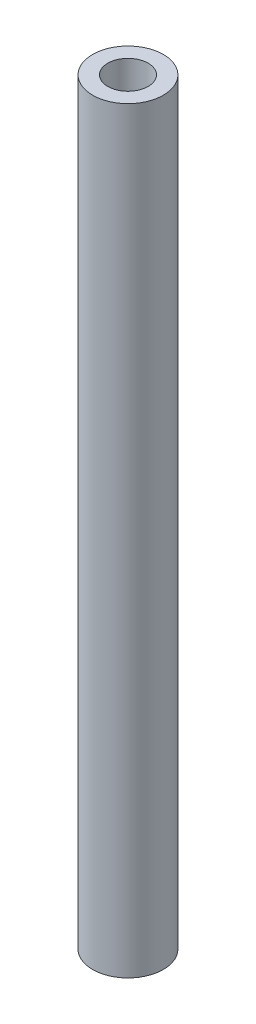
ISO-10303-21;
HEADER;
FILE_DESCRIPTION(('STEP AP214'),'2;1');
FILE_NAME('part.step','',(''),(''),'','','');
FILE_SCHEMA(('AUTOMOTIVE_DESIGN { 1 0 10303 214 1 1 1 1 }'));
ENDSEC;
DATA;
#1=APPLICATION_CONTEXT('core data for automotive mechanical design processes');
#2=APPLICATION_PROTOCOL_DEFINITION('international standard','automotive_design',2000,#1);
#3=PRODUCT_CONTEXT('',#1,'mechanical');
#4=PRODUCT('Part','Part','',(#3));
#5=PRODUCT_RELATED_PRODUCT_CATEGORY('part','',(#4));
#6=PRODUCT_DEFINITION_FORMATION('','',#4);
#7=PRODUCT_DEFINITION_CONTEXT('part definition',#1,'design');
#8=PRODUCT_DEFINITION('design','',#6,#7);
#9=PRODUCT_DEFINITION_SHAPE('','',#8);
#10=(LENGTH_UNIT() NAMED_UNIT(*) SI_UNIT(.MILLI.,.METRE.));
#11=(NAMED_UNIT(*) PLANE_ANGLE_UNIT() SI_UNIT($,.RADIAN.));
#12=(NAMED_UNIT(*) SI_UNIT($,.STERADIAN.) SOLID_ANGLE_UNIT());
#13=UNCERTAINTY_MEASURE_WITH_UNIT(LENGTH_MEASURE(1.E-05),#10,'distance_accuracy_value','');
#14=(GEOMETRIC_REPRESENTATION_CONTEXT(3) GLOBAL_UNCERTAINTY_ASSIGNED_CONTEXT((#13)) GLOBAL_UNIT_ASSIGNED_CONTEXT((#10,
#11,#12)) REPRESENTATION_CONTEXT('',''));
#15=CARTESIAN_POINT('',(0.,0.,0.));
#16=DIRECTION('',(0.,0.,1.));
#17=DIRECTION('',(1.,0.,0.));
#18=AXIS2_PLACEMENT_3D('',#15,#16,#17);
#19=CARTESIAN_POINT('',(-56.7146055400372,-75.,0.));
#20=DIRECTION('',(0.,1.,0.));
#21=DIRECTION('',(-1.,0.,0.));
#22=AXIS2_PLACEMENT_3D('',#19,#20,#21);
#23=CYLINDRICAL_SURFACE('',#22,3.50000000000001);
#24=CARTESIAN_POINT('',(-56.7146055400372,-75.,0.));
#25=DIRECTION('',(0.,1.,0.));
#26=DIRECTION('',(-1.,0.,0.));
#27=AXIS2_PLACEMENT_3D('',#24,#25,#26);
#28=CIRCLE('',#27,3.50000000000001);
#29=CARTESIAN_POINT('',(-60.2146055400372,-75.,0.));
#30=VERTEX_POINT('',#29);
#31=EDGE_CURVE('E10',#30,#30,#28,.T.);
#32=ORIENTED_EDGE('',*,*,#31,.T.);
#33=EDGE_LOOP('',(#32));
#34=FACE_BOUND('',#33,.T.);
#35=CARTESIAN_POINT('',(-56.7146055400372,0.,0.));
#36=DIRECTION('',(0.,1.,0.));
#37=DIRECTION('',(-1.,0.,0.));
#38=AXIS2_PLACEMENT_3D('',#35,#36,#37);
#39=CIRCLE('',#38,3.5);
#40=CARTESIAN_POINT('',(-60.2146055400372,0.,0.));
#41=VERTEX_POINT('',#40);
#42=EDGE_CURVE('E44',#41,#41,#39,.T.);
#43=ORIENTED_EDGE('',*,*,#42,.F.);
#44=EDGE_LOOP('',(#43));
#45=FACE_BOUND('',#44,.T.);
#46=ADVANCED_FACE('F30',(#34,#45),#23,.T.);
#47=CARTESIAN_POINT('',(-53.2146055400372,-75.,0.));
#48=DIRECTION('',(0.,-1.,0.));
#49=DIRECTION('',(1.,0.,0.));
#50=AXIS2_PLACEMENT_3D('',#47,#48,#49);
#51=PLANE('',#50);
#52=CARTESIAN_POINT('',(-56.7146055400372,-75.,0.));
#53=DIRECTION('',(0.,1.,0.));
#54=DIRECTION('',(-1.,0.,0.));
#55=AXIS2_PLACEMENT_3D('',#52,#53,#54);
#56=CIRCLE('',#55,2.);
#57=CARTESIAN_POINT('',(-58.7146055400372,-75.,0.));
#58=VERTEX_POINT('',#57);
#59=EDGE_CURVE('E36',#58,#58,#56,.T.);
#60=ORIENTED_EDGE('',*,*,#59,.T.);
#61=EDGE_LOOP('',(#60));
#62=FACE_BOUND('',#61,.T.);
#63=ORIENTED_EDGE('',*,*,#31,.F.);
#64=EDGE_LOOP('',(#63));
#65=FACE_BOUND('',#64,.T.);
#66=ADVANCED_FACE('F54',(#62,#65),#51,.T.);
#67=CARTESIAN_POINT('',(-56.7146055400372,-75.,0.));
#68=DIRECTION('',(0.,1.,0.));
#69=DIRECTION('',(-1.,0.,0.));
#70=AXIS2_PLACEMENT_3D('',#67,#68,#69);
#71=CYLINDRICAL_SURFACE('',#70,2.);
#72=CARTESIAN_POINT('',(-56.7146055400372,0.,0.));
#73=DIRECTION('',(0.,1.,0.));
#74=DIRECTION('',(-1.,0.,0.));
#75=AXIS2_PLACEMENT_3D('',#72,#73,#74);
#76=CIRCLE('',#75,2.);
#77=CARTESIAN_POINT('',(-58.7146055400372,0.,0.));
#78=VERTEX_POINT('',#77);
#79=EDGE_CURVE('E40',#78,#78,#76,.T.);
#80=ORIENTED_EDGE('',*,*,#79,.T.);
#81=EDGE_LOOP('',(#80));
#82=FACE_BOUND('',#81,.T.);
#83=ORIENTED_EDGE('',*,*,#59,.F.);
#84=EDGE_LOOP('',(#83));
#85=FACE_BOUND('',#84,.T.);
#86=ADVANCED_FACE('F58',(#82,#85),#71,.F.);
#87=CARTESIAN_POINT('',(-54.7146055400372,0.,0.));
#88=DIRECTION('',(0.,1.,0.));
#89=DIRECTION('',(-1.,0.,0.));
#90=AXIS2_PLACEMENT_3D('',#87,#88,#89);
#91=PLANE('',#90);
#92=ORIENTED_EDGE('',*,*,#42,.T.);
#93=EDGE_LOOP('',(#92));
#94=FACE_BOUND('',#93,.T.);
#95=ORIENTED_EDGE('',*,*,#79,.F.);
#96=EDGE_LOOP('',(#95));
#97=FACE_BOUND('',#96,.T.);
#98=ADVANCED_FACE('F50',(#94,#97),#91,.T.);
#99=CLOSED_SHELL('',(#46,#66,#86,#98));
#100=MANIFOLD_SOLID_BREP('B2',#99);
#101=ADVANCED_BREP_SHAPE_REPRESENTATION('',(#18,#100),#14);
#102=SHAPE_DEFINITION_REPRESENTATION(#9,#101);
ENDSEC;
END-ISO-10303-21;
